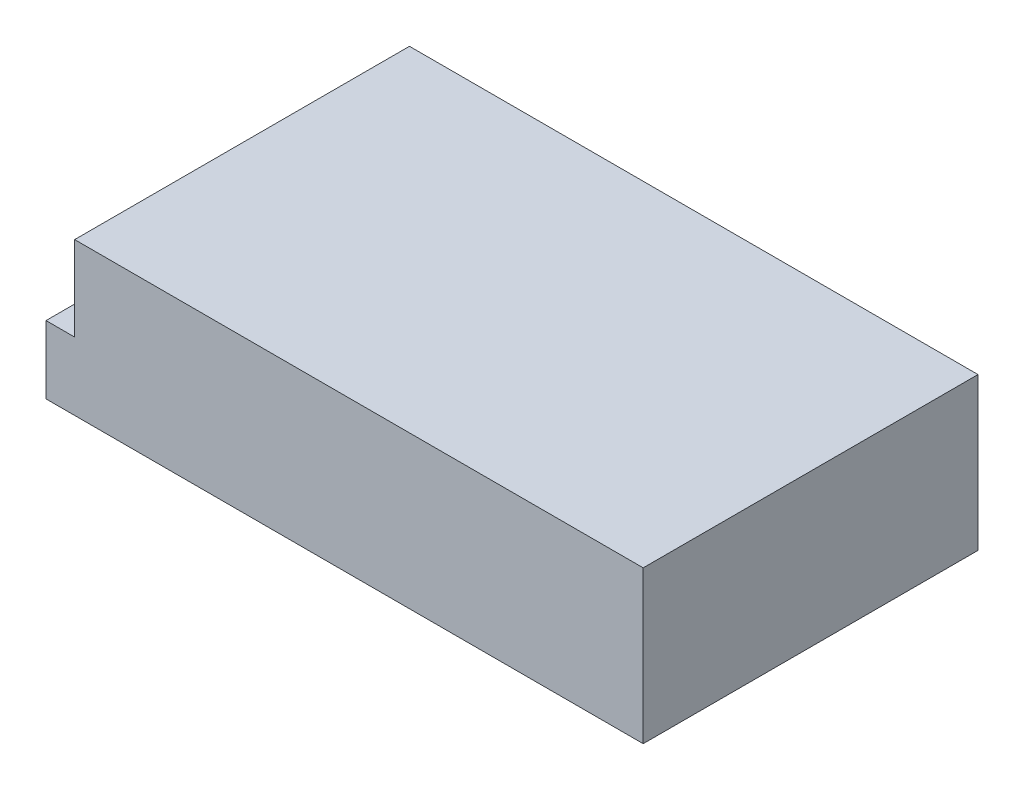
ISO-10303-21;
HEADER;
FILE_DESCRIPTION(('STEP AP214'),'2;1');
FILE_NAME('part.step','',(''),(''),'','','');
FILE_SCHEMA(('AUTOMOTIVE_DESIGN { 1 0 10303 214 1 1 1 1 }'));
ENDSEC;
DATA;
#1=APPLICATION_CONTEXT('core data for automotive mechanical design processes');
#2=APPLICATION_PROTOCOL_DEFINITION('international standard','automotive_design',2000,#1);
#3=PRODUCT_CONTEXT('',#1,'mechanical');
#4=PRODUCT('Part','Part','',(#3));
#5=PRODUCT_RELATED_PRODUCT_CATEGORY('part','',(#4));
#6=PRODUCT_DEFINITION_FORMATION('','',#4);
#7=PRODUCT_DEFINITION_CONTEXT('part definition',#1,'design');
#8=PRODUCT_DEFINITION('design','',#6,#7);
#9=PRODUCT_DEFINITION_SHAPE('','',#8);
#10=(LENGTH_UNIT() NAMED_UNIT(*) SI_UNIT(.MILLI.,.METRE.));
#11=(NAMED_UNIT(*) PLANE_ANGLE_UNIT() SI_UNIT($,.RADIAN.));
#12=(NAMED_UNIT(*) SI_UNIT($,.STERADIAN.) SOLID_ANGLE_UNIT());
#13=UNCERTAINTY_MEASURE_WITH_UNIT(LENGTH_MEASURE(1.E-05),#10,'distance_accuracy_value','');
#14=(GEOMETRIC_REPRESENTATION_CONTEXT(3) GLOBAL_UNCERTAINTY_ASSIGNED_CONTEXT((#13)) GLOBAL_UNIT_ASSIGNED_CONTEXT((#10,
#11,#12)) REPRESENTATION_CONTEXT('',''));
#15=CARTESIAN_POINT('',(0.,0.,0.));
#16=DIRECTION('',(0.,0.,1.));
#17=DIRECTION('',(1.,0.,0.));
#18=AXIS2_PLACEMENT_3D('',#15,#16,#17);
#19=CARTESIAN_POINT('',(-99.,50.5,-55.5));
#20=DIRECTION('',(1.,0.,0.));
#21=DIRECTION('',(0.,0.,-1.));
#22=AXIS2_PLACEMENT_3D('',#19,#20,#21);
#23=PLANE('',#22);
#24=DIRECTION('',(0.,-1.,0.));
#25=VECTOR('',#24,1.);
#26=CARTESIAN_POINT('',(-99.,50.5,55.5));
#27=LINE('',#26,#25);
#28=CARTESIAN_POINT('',(-99.,22.5,55.5));
#29=VERTEX_POINT('',#28);
#30=CARTESIAN_POINT('',(-99.,0.,55.5));
#31=VERTEX_POINT('',#30);
#32=EDGE_CURVE('E41',#29,#31,#27,.T.);
#33=ORIENTED_EDGE('',*,*,#32,.F.);
#34=DIRECTION('',(0.,0.,-1.));
#35=VECTOR('',#34,1.);
#36=CARTESIAN_POINT('',(-99.,22.5,92.0000000000001));
#37=LINE('',#36,#35);
#38=CARTESIAN_POINT('',(-99.,22.5,-55.5));
#39=VERTEX_POINT('',#38);
#40=EDGE_CURVE('E83',#29,#39,#37,.T.);
#41=ORIENTED_EDGE('',*,*,#40,.T.);
#42=DIRECTION('',(0.,-1.,0.));
#43=VECTOR('',#42,1.);
#44=CARTESIAN_POINT('',(-99.,50.5,-55.5));
#45=LINE('',#44,#43);
#46=CARTESIAN_POINT('',(-99.,0.,-55.5));
#47=VERTEX_POINT('',#46);
#48=EDGE_CURVE('E76',#39,#47,#45,.T.);
#49=ORIENTED_EDGE('',*,*,#48,.T.);
#50=DIRECTION('',(0.,0.,1.));
#51=VECTOR('',#50,1.);
#52=CARTESIAN_POINT('',(-99.,0.,-55.5));
#53=LINE('',#52,#51);
#54=EDGE_CURVE('E80',#47,#31,#53,.T.);
#55=ORIENTED_EDGE('',*,*,#54,.T.);
#56=EDGE_LOOP('',(#33,#41,#49,#55));
#57=FACE_BOUND('',#56,.T.);
#58=ADVANCED_FACE('F34',(#57),#23,.F.);
#59=CARTESIAN_POINT('',(-99.,50.5,55.5));
#60=DIRECTION('',(0.,0.,-1.));
#61=DIRECTION('',(-1.,0.,0.));
#62=AXIS2_PLACEMENT_3D('',#59,#60,#61);
#63=PLANE('',#62);
#64=DIRECTION('',(1.,0.,0.));
#65=VECTOR('',#64,1.);
#66=CARTESIAN_POINT('',(-99.,50.5,55.5));
#67=LINE('',#66,#65);
#68=CARTESIAN_POINT('',(-89.5,50.5,55.5));
#69=VERTEX_POINT('',#68);
#70=CARTESIAN_POINT('',(99.,50.5,55.5));
#71=VERTEX_POINT('',#70);
#72=EDGE_CURVE('E96',#69,#71,#67,.T.);
#73=ORIENTED_EDGE('',*,*,#72,.F.);
#74=DIRECTION('',(0.,-1.,0.));
#75=VECTOR('',#74,1.);
#76=CARTESIAN_POINT('',(-89.5,50.5,55.5));
#77=LINE('',#76,#75);
#78=CARTESIAN_POINT('',(-89.5,22.5,55.5));
#79=VERTEX_POINT('',#78);
#80=EDGE_CURVE('E47',#69,#79,#77,.T.);
#81=ORIENTED_EDGE('',*,*,#80,.T.);
#82=DIRECTION('',(-1.,0.,0.));
#83=VECTOR('',#82,1.);
#84=CARTESIAN_POINT('',(-99.,22.5,55.5));
#85=LINE('',#84,#83);
#86=EDGE_CURVE('E102',#79,#29,#85,.T.);
#87=ORIENTED_EDGE('',*,*,#86,.T.);
#88=ORIENTED_EDGE('',*,*,#32,.T.);
#89=DIRECTION('',(1.,0.,0.));
#90=VECTOR('',#89,1.);
#91=CARTESIAN_POINT('',(-99.,0.,55.5));
#92=LINE('',#91,#90);
#93=CARTESIAN_POINT('',(99.,0.,55.5));
#94=VERTEX_POINT('',#93);
#95=EDGE_CURVE('E101',#31,#94,#92,.T.);
#96=ORIENTED_EDGE('',*,*,#95,.T.);
#97=DIRECTION('',(0.,-1.,0.));
#98=VECTOR('',#97,1.);
#99=CARTESIAN_POINT('',(99.,50.5,55.5));
#100=LINE('',#99,#98);
#101=EDGE_CURVE('E112',#71,#94,#100,.T.);
#102=ORIENTED_EDGE('',*,*,#101,.F.);
#103=EDGE_LOOP('',(#73,#81,#87,#88,#96,#102));
#104=FACE_BOUND('',#103,.T.);
#105=ADVANCED_FACE('F116',(#104),#63,.F.);
#106=CARTESIAN_POINT('',(99.,50.5,-55.5));
#107=DIRECTION('',(-1.,0.,0.));
#108=DIRECTION('',(0.,0.,1.));
#109=AXIS2_PLACEMENT_3D('',#106,#107,#108);
#110=PLANE('',#109);
#111=DIRECTION('',(0.,0.,-1.));
#112=VECTOR('',#111,1.);
#113=CARTESIAN_POINT('',(99.,0.,-55.5));
#114=LINE('',#113,#112);
#115=CARTESIAN_POINT('',(99.,0.,-55.5));
#116=VERTEX_POINT('',#115);
#117=EDGE_CURVE('E97',#94,#116,#114,.T.);
#118=ORIENTED_EDGE('',*,*,#117,.T.);
#119=DIRECTION('',(0.,-1.,0.));
#120=VECTOR('',#119,1.);
#121=CARTESIAN_POINT('',(99.,50.5,-55.5));
#122=LINE('',#121,#120);
#123=CARTESIAN_POINT('',(99.,50.5,-55.5));
#124=VERTEX_POINT('',#123);
#125=EDGE_CURVE('E86',#124,#116,#122,.T.);
#126=ORIENTED_EDGE('',*,*,#125,.F.);
#127=DIRECTION('',(0.,0.,-1.));
#128=VECTOR('',#127,1.);
#129=CARTESIAN_POINT('',(99.,50.5,-55.5));
#130=LINE('',#129,#128);
#131=EDGE_CURVE('E56',#71,#124,#130,.T.);
#132=ORIENTED_EDGE('',*,*,#131,.F.);
#133=ORIENTED_EDGE('',*,*,#101,.T.);
#134=EDGE_LOOP('',(#118,#126,#132,#133));
#135=FACE_BOUND('',#134,.T.);
#136=ADVANCED_FACE('F146',(#135),#110,.F.);
#137=CARTESIAN_POINT('',(-99.,50.5,-55.5));
#138=DIRECTION('',(0.,0.,1.));
#139=DIRECTION('',(1.,0.,0.));
#140=AXIS2_PLACEMENT_3D('',#137,#138,#139);
#141=PLANE('',#140);
#142=DIRECTION('',(-1.,0.,0.));
#143=VECTOR('',#142,1.);
#144=CARTESIAN_POINT('',(-89.5,22.5,-55.5));
#145=LINE('',#144,#143);
#146=CARTESIAN_POINT('',(-89.5,22.5,-55.5));
#147=VERTEX_POINT('',#146);
#148=EDGE_CURVE('E132',#147,#39,#145,.T.);
#149=ORIENTED_EDGE('',*,*,#148,.F.);
#150=DIRECTION('',(0.,-1.,0.));
#151=VECTOR('',#150,1.);
#152=CARTESIAN_POINT('',(-89.5,50.5,-55.5));
#153=LINE('',#152,#151);
#154=CARTESIAN_POINT('',(-89.5,50.5,-55.5));
#155=VERTEX_POINT('',#154);
#156=EDGE_CURVE('E135',#155,#147,#153,.T.);
#157=ORIENTED_EDGE('',*,*,#156,.F.);
#158=DIRECTION('',(-1.,0.,0.));
#159=VECTOR('',#158,1.);
#160=CARTESIAN_POINT('',(-99.,50.5,-55.5));
#161=LINE('',#160,#159);
#162=EDGE_CURVE('E87',#124,#155,#161,.T.);
#163=ORIENTED_EDGE('',*,*,#162,.F.);
#164=ORIENTED_EDGE('',*,*,#125,.T.);
#165=DIRECTION('',(-1.,0.,0.));
#166=VECTOR('',#165,1.);
#167=CARTESIAN_POINT('',(-99.,0.,-55.5));
#168=LINE('',#167,#166);
#169=EDGE_CURVE('E91',#116,#47,#168,.T.);
#170=ORIENTED_EDGE('',*,*,#169,.T.);
#171=ORIENTED_EDGE('',*,*,#48,.F.);
#172=EDGE_LOOP('',(#149,#157,#163,#164,#170,#171));
#173=FACE_BOUND('',#172,.T.);
#174=ADVANCED_FACE('F92',(#173),#141,.F.);
#175=CARTESIAN_POINT('',(0.,50.5,0.));
#176=DIRECTION('',(0.,1.,0.));
#177=DIRECTION('',(0.,0.,1.));
#178=AXIS2_PLACEMENT_3D('',#175,#176,#177);
#179=PLANE('',#178);
#180=DIRECTION('',(0.,0.,-1.));
#181=VECTOR('',#180,1.);
#182=CARTESIAN_POINT('',(-89.5,50.5,0.));
#183=LINE('',#182,#181);
#184=EDGE_CURVE('E11',#69,#155,#183,.T.);
#185=ORIENTED_EDGE('',*,*,#184,.F.);
#186=ORIENTED_EDGE('',*,*,#72,.T.);
#187=ORIENTED_EDGE('',*,*,#131,.T.);
#188=ORIENTED_EDGE('',*,*,#162,.T.);
#189=EDGE_LOOP('',(#185,#186,#187,#188));
#190=FACE_BOUND('',#189,.T.);
#191=ADVANCED_FACE('F144',(#190),#179,.T.);
#192=CARTESIAN_POINT('',(0.,0.,0.));
#193=DIRECTION('',(0.,1.,0.));
#194=DIRECTION('',(0.,0.,1.));
#195=AXIS2_PLACEMENT_3D('',#192,#193,#194);
#196=PLANE('',#195);
#197=CARTESIAN_POINT('',(-39.,0.,-45.5));
#198=DIRECTION('',(0.,-1.,0.));
#199=DIRECTION('',(0.,0.,-1.));
#200=AXIS2_PLACEMENT_3D('',#197,#198,#199);
#201=CIRCLE('',#200,1.5);
#202=CARTESIAN_POINT('',(-39.,0.,-47.));
#203=VERTEX_POINT('',#202);
#204=EDGE_CURVE('E289',#203,#203,#201,.T.);
#205=ORIENTED_EDGE('',*,*,#204,.F.);
#206=EDGE_LOOP('',(#205));
#207=FACE_BOUND('',#206,.T.);
#208=CARTESIAN_POINT('',(-39.,0.,39.5));
#209=DIRECTION('',(0.,-1.,0.));
#210=DIRECTION('',(0.,0.,-1.));
#211=AXIS2_PLACEMENT_3D('',#208,#209,#210);
#212=CIRCLE('',#211,1.5);
#213=CARTESIAN_POINT('',(-39.,0.,38.));
#214=VERTEX_POINT('',#213);
#215=EDGE_CURVE('E288',#214,#214,#212,.T.);
#216=ORIENTED_EDGE('',*,*,#215,.F.);
#217=EDGE_LOOP('',(#216));
#218=FACE_BOUND('',#217,.T.);
#219=CARTESIAN_POINT('',(87.,0.,-45.5));
#220=DIRECTION('',(0.,-1.,0.));
#221=DIRECTION('',(0.,0.,-1.));
#222=AXIS2_PLACEMENT_3D('',#219,#220,#221);
#223=CIRCLE('',#222,1.5);
#224=CARTESIAN_POINT('',(87.,0.,-47.));
#225=VERTEX_POINT('',#224);
#226=EDGE_CURVE('E298',#225,#225,#223,.T.);
#227=ORIENTED_EDGE('',*,*,#226,.F.);
#228=EDGE_LOOP('',(#227));
#229=FACE_BOUND('',#228,.T.);
#230=CARTESIAN_POINT('',(87.,0.,39.5));
#231=DIRECTION('',(0.,-1.,0.));
#232=DIRECTION('',(0.,0.,-1.));
#233=AXIS2_PLACEMENT_3D('',#230,#231,#232);
#234=CIRCLE('',#233,1.5);
#235=CARTESIAN_POINT('',(87.,0.,38.));
#236=VERTEX_POINT('',#235);
#237=EDGE_CURVE('E303',#236,#236,#234,.T.);
#238=ORIENTED_EDGE('',*,*,#237,.F.);
#239=EDGE_LOOP('',(#238));
#240=FACE_BOUND('',#239,.T.);
#241=ORIENTED_EDGE('',*,*,#54,.F.);
#242=ORIENTED_EDGE('',*,*,#169,.F.);
#243=ORIENTED_EDGE('',*,*,#117,.F.);
#244=ORIENTED_EDGE('',*,*,#95,.F.);
#245=EDGE_LOOP('',(#241,#242,#243,#244));
#246=FACE_BOUND('',#245,.T.);
#247=ADVANCED_FACE('F100',(#207,#218,#229,#240,#246),#196,.F.);
#248=CARTESIAN_POINT('',(-89.5,22.5,92.0000000000001));
#249=DIRECTION('',(0.,-1.,0.));
#250=DIRECTION('',(0.,0.,-1.));
#251=AXIS2_PLACEMENT_3D('',#248,#249,#250);
#252=PLANE('',#251);
#253=DIRECTION('',(0.,0.,-1.));
#254=VECTOR('',#253,1.);
#255=CARTESIAN_POINT('',(-89.5,22.5,92.0000000000001));
#256=LINE('',#255,#254);
#257=EDGE_CURVE('E129',#79,#147,#256,.T.);
#258=ORIENTED_EDGE('',*,*,#257,.T.);
#259=ORIENTED_EDGE('',*,*,#148,.T.);
#260=ORIENTED_EDGE('',*,*,#40,.F.);
#261=ORIENTED_EDGE('',*,*,#86,.F.);
#262=EDGE_LOOP('',(#258,#259,#260,#261));
#263=FACE_BOUND('',#262,.T.);
#264=ADVANCED_FACE('F131',(#263),#252,.F.);
#265=CARTESIAN_POINT('',(-89.5,50.5,92.0000000000001));
#266=DIRECTION('',(1.,0.,0.));
#267=DIRECTION('',(0.,1.,0.));
#268=AXIS2_PLACEMENT_3D('',#265,#266,#267);
#269=PLANE('',#268);
#270=ORIENTED_EDGE('',*,*,#184,.T.);
#271=ORIENTED_EDGE('',*,*,#156,.T.);
#272=ORIENTED_EDGE('',*,*,#257,.F.);
#273=ORIENTED_EDGE('',*,*,#80,.F.);
#274=EDGE_LOOP('',(#270,#271,#272,#273));
#275=FACE_BOUND('',#274,.T.);
#276=ADVANCED_FACE('F136',(#275),#269,.F.);
#277=CARTESIAN_POINT('',(87.,3.,39.5));
#278=DIRECTION('',(0.,-1.,0.));
#279=DIRECTION('',(0.,0.,-1.));
#280=AXIS2_PLACEMENT_3D('',#277,#278,#279);
#281=CYLINDRICAL_SURFACE('',#280,1.5);
#282=CARTESIAN_POINT('',(87.,3.,39.5));
#283=DIRECTION('',(0.,-1.,0.));
#284=DIRECTION('',(0.,0.,-1.));
#285=AXIS2_PLACEMENT_3D('',#282,#283,#284);
#286=CIRCLE('',#285,1.5);
#287=CARTESIAN_POINT('',(87.,3.,38.));
#288=VERTEX_POINT('',#287);
#289=EDGE_CURVE('E137',#288,#288,#286,.T.);
#290=ORIENTED_EDGE('',*,*,#289,.F.);
#291=EDGE_LOOP('',(#290));
#292=FACE_BOUND('',#291,.T.);
#293=ORIENTED_EDGE('',*,*,#237,.T.);
#294=EDGE_LOOP('',(#293));
#295=FACE_BOUND('',#294,.T.);
#296=ADVANCED_FACE('F195',(#292,#295),#281,.F.);
#297=CARTESIAN_POINT('',(87.,3.,39.5));
#298=DIRECTION('',(0.,-1.,0.));
#299=DIRECTION('',(0.,0.,-1.));
#300=AXIS2_PLACEMENT_3D('',#297,#298,#299);
#301=PLANE('',#300);
#302=ORIENTED_EDGE('',*,*,#289,.T.);
#303=EDGE_LOOP('',(#302));
#304=FACE_BOUND('',#303,.T.);
#305=ADVANCED_FACE('F211',(#304),#301,.T.);
#306=CARTESIAN_POINT('',(87.,3.,-45.5));
#307=DIRECTION('',(0.,-1.,0.));
#308=DIRECTION('',(0.,0.,-1.));
#309=AXIS2_PLACEMENT_3D('',#306,#307,#308);
#310=CYLINDRICAL_SURFACE('',#309,1.5);
#311=CARTESIAN_POINT('',(87.,3.,-45.5));
#312=DIRECTION('',(0.,-1.,0.));
#313=DIRECTION('',(0.,0.,-1.));
#314=AXIS2_PLACEMENT_3D('',#311,#312,#313);
#315=CIRCLE('',#314,1.5);
#316=CARTESIAN_POINT('',(87.,3.,-47.));
#317=VERTEX_POINT('',#316);
#318=EDGE_CURVE('E300',#317,#317,#315,.T.);
#319=ORIENTED_EDGE('',*,*,#318,.F.);
#320=EDGE_LOOP('',(#319));
#321=FACE_BOUND('',#320,.T.);
#322=ORIENTED_EDGE('',*,*,#226,.T.);
#323=EDGE_LOOP('',(#322));
#324=FACE_BOUND('',#323,.T.);
#325=ADVANCED_FACE('F221',(#321,#324),#310,.F.);
#326=CARTESIAN_POINT('',(87.,3.,-45.5));
#327=DIRECTION('',(0.,-1.,0.));
#328=DIRECTION('',(0.,0.,-1.));
#329=AXIS2_PLACEMENT_3D('',#326,#327,#328);
#330=PLANE('',#329);
#331=ORIENTED_EDGE('',*,*,#318,.T.);
#332=EDGE_LOOP('',(#331));
#333=FACE_BOUND('',#332,.T.);
#334=ADVANCED_FACE('F231',(#333),#330,.T.);
#335=CARTESIAN_POINT('',(-39.,3.,39.5));
#336=DIRECTION('',(0.,-1.,0.));
#337=DIRECTION('',(0.,0.,-1.));
#338=AXIS2_PLACEMENT_3D('',#335,#336,#337);
#339=CYLINDRICAL_SURFACE('',#338,1.5);
#340=CARTESIAN_POINT('',(-39.,3.,39.5));
#341=DIRECTION('',(0.,-1.,0.));
#342=DIRECTION('',(0.,0.,-1.));
#343=AXIS2_PLACEMENT_3D('',#340,#341,#342);
#344=CIRCLE('',#343,1.5);
#345=CARTESIAN_POINT('',(-39.,3.,38.));
#346=VERTEX_POINT('',#345);
#347=EDGE_CURVE('E292',#346,#346,#344,.T.);
#348=ORIENTED_EDGE('',*,*,#347,.F.);
#349=EDGE_LOOP('',(#348));
#350=FACE_BOUND('',#349,.T.);
#351=ORIENTED_EDGE('',*,*,#215,.T.);
#352=EDGE_LOOP('',(#351));
#353=FACE_BOUND('',#352,.T.);
#354=ADVANCED_FACE('F241',(#350,#353),#339,.F.);
#355=CARTESIAN_POINT('',(-39.,3.,39.5));
#356=DIRECTION('',(0.,-1.,0.));
#357=DIRECTION('',(0.,0.,-1.));
#358=AXIS2_PLACEMENT_3D('',#355,#356,#357);
#359=PLANE('',#358);
#360=ORIENTED_EDGE('',*,*,#347,.T.);
#361=EDGE_LOOP('',(#360));
#362=FACE_BOUND('',#361,.T.);
#363=ADVANCED_FACE('F251',(#362),#359,.T.);
#364=CARTESIAN_POINT('',(-39.,3.,-45.5));
#365=DIRECTION('',(0.,-1.,0.));
#366=DIRECTION('',(0.,0.,-1.));
#367=AXIS2_PLACEMENT_3D('',#364,#365,#366);
#368=CYLINDRICAL_SURFACE('',#367,1.5);
#369=CARTESIAN_POINT('',(-39.,3.,-45.5));
#370=DIRECTION('',(0.,-1.,0.));
#371=DIRECTION('',(0.,0.,-1.));
#372=AXIS2_PLACEMENT_3D('',#369,#370,#371);
#373=CIRCLE('',#372,1.5);
#374=CARTESIAN_POINT('',(-39.,3.,-47.));
#375=VERTEX_POINT('',#374);
#376=EDGE_CURVE('E287',#375,#375,#373,.T.);
#377=ORIENTED_EDGE('',*,*,#376,.F.);
#378=EDGE_LOOP('',(#377));
#379=FACE_BOUND('',#378,.T.);
#380=ORIENTED_EDGE('',*,*,#204,.T.);
#381=EDGE_LOOP('',(#380));
#382=FACE_BOUND('',#381,.T.);
#383=ADVANCED_FACE('F261',(#379,#382),#368,.F.);
#384=CARTESIAN_POINT('',(-39.,3.,-45.5));
#385=DIRECTION('',(0.,-1.,0.));
#386=DIRECTION('',(0.,0.,-1.));
#387=AXIS2_PLACEMENT_3D('',#384,#385,#386);
#388=PLANE('',#387);
#389=ORIENTED_EDGE('',*,*,#376,.T.);
#390=EDGE_LOOP('',(#389));
#391=FACE_BOUND('',#390,.T.);
#392=ADVANCED_FACE('F271',(#391),#388,.T.);
#393=CLOSED_SHELL('',(#58,#105,#136,#174,#191,#247,#264,#276,#296,#305,#325,#334,#354,#363,#383,#392));
#394=MANIFOLD_SOLID_BREP('B2',#393);
#395=ADVANCED_BREP_SHAPE_REPRESENTATION('',(#18,#394),#14);
#396=SHAPE_DEFINITION_REPRESENTATION(#9,#395);
ENDSEC;
END-ISO-10303-21;
